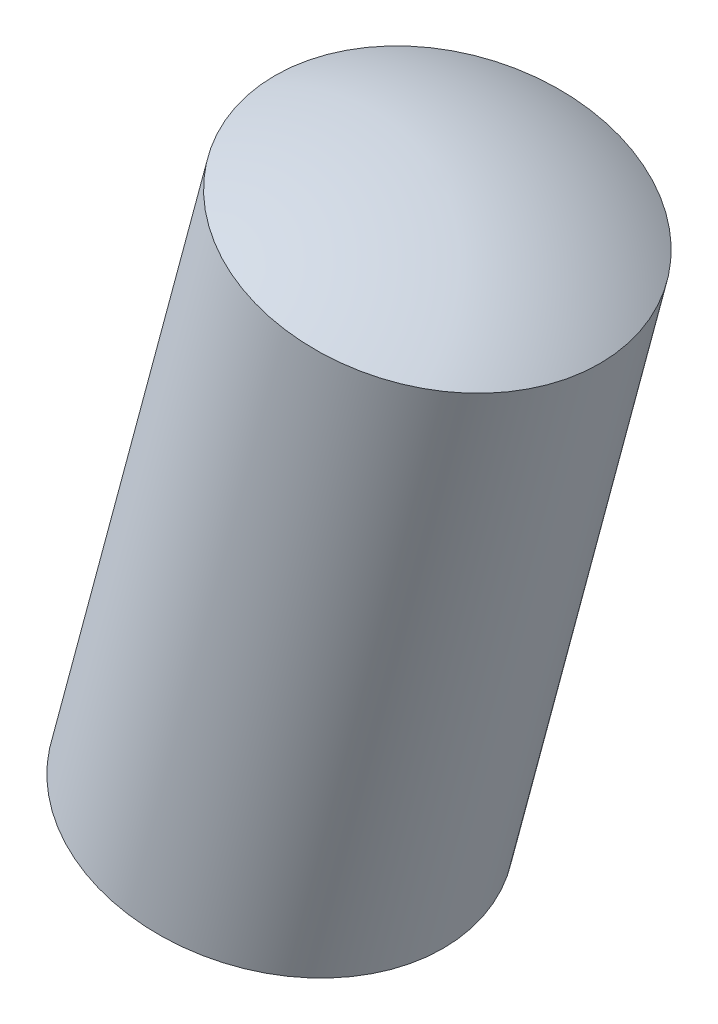
ISO-10303-21;
HEADER;
FILE_DESCRIPTION(('STEP AP214'),'2;1');
FILE_NAME('part.step','',(''),(''),'','','');
FILE_SCHEMA(('AUTOMOTIVE_DESIGN { 1 0 10303 214 1 1 1 1 }'));
ENDSEC;
DATA;
#1=APPLICATION_CONTEXT('core data for automotive mechanical design processes');
#2=APPLICATION_PROTOCOL_DEFINITION('international standard','automotive_design',2000,#1);
#3=PRODUCT_CONTEXT('',#1,'mechanical');
#4=PRODUCT('Part','Part','',(#3));
#5=PRODUCT_RELATED_PRODUCT_CATEGORY('part','',(#4));
#6=PRODUCT_DEFINITION_FORMATION('','',#4);
#7=PRODUCT_DEFINITION_CONTEXT('part definition',#1,'design');
#8=PRODUCT_DEFINITION('design','',#6,#7);
#9=PRODUCT_DEFINITION_SHAPE('','',#8);
#10=(LENGTH_UNIT() NAMED_UNIT(*) SI_UNIT(.MILLI.,.METRE.));
#11=(NAMED_UNIT(*) PLANE_ANGLE_UNIT() SI_UNIT($,.RADIAN.));
#12=(NAMED_UNIT(*) SI_UNIT($,.STERADIAN.) SOLID_ANGLE_UNIT());
#13=UNCERTAINTY_MEASURE_WITH_UNIT(LENGTH_MEASURE(1.E-05),#10,'distance_accuracy_value','');
#14=(GEOMETRIC_REPRESENTATION_CONTEXT(3) GLOBAL_UNCERTAINTY_ASSIGNED_CONTEXT((#13)) GLOBAL_UNIT_ASSIGNED_CONTEXT((#10,
#11,#12)) REPRESENTATION_CONTEXT('',''));
#15=CARTESIAN_POINT('',(0.,0.,0.));
#16=DIRECTION('',(0.,0.,1.));
#17=DIRECTION('',(1.,0.,0.));
#18=AXIS2_PLACEMENT_3D('',#15,#16,#17);
#19=CARTESIAN_POINT('',(-7.1439035579701,-26.6614110427164,0.9));
#20=DIRECTION('',(-0.965925826289068,0.258819045102522,0.));
#21=DIRECTION('',(-0.258819045102522,-0.965925826289068,0.));
#22=AXIS2_PLACEMENT_3D('',#19,#20,#21);
#23=SPHERICAL_SURFACE('',#22,3.);
#24=CARTESIAN_POINT('',(-7.1439035579701,-26.6614110427164,0.9));
#25=DIRECTION('',(0.258819045102522,0.965925826289068,0.));
#26=DIRECTION('',(0.,0.,-1.));
#27=AXIS2_PLACEMENT_3D('',#24,#25,#26);
#28=SPHERICAL_SURFACE('',#27,3.);
#29=CARTESIAN_POINT('',(-7.81633516209614,-29.17095995393,0.9));
#30=DIRECTION('',(0.258819045102522,0.965925826289068,0.));
#31=DIRECTION('',(0.,0.,-1.));
#32=AXIS2_PLACEMENT_3D('',#29,#30,#31);
#33=CIRCLE('',#32,1.5);
#34=CARTESIAN_POINT('',(-7.81633516209614,-29.17095995393,-0.6));
#35=VERTEX_POINT('',#34);
#36=EDGE_CURVE('E11',#35,#35,#33,.T.);
#37=ORIENTED_EDGE('',*,*,#36,.F.);
#38=EDGE_LOOP('',(#37));
#39=FACE_BOUND('',#38,.T.);
#40=ADVANCED_FACE('F17',(#39),#28,.T.);
#41=CARTESIAN_POINT('',(-7.09114392266856,-26.4645094031823,0.9));
#42=DIRECTION('',(-0.965925826289068,0.258819045102522,0.));
#43=DIRECTION('',(0.258819045102522,0.965925826289068,0.));
#44=AXIS2_PLACEMENT_3D('',#41,#42,#43);
#45=SPHERICAL_SURFACE('',#44,3.);
#46=CARTESIAN_POINT('',(-7.09114392266856,-26.4645094031823,0.9));
#47=DIRECTION('',(0.258819045102522,0.965925826289068,0.));
#48=DIRECTION('',(0.,0.,-1.));
#49=AXIS2_PLACEMENT_3D('',#46,#47,#48);
#50=SPHERICAL_SURFACE('',#49,3.);
#51=CARTESIAN_POINT('',(-6.41871231854252,-23.9549604919689,0.9));
#52=DIRECTION('',(0.258819045102522,0.965925826289068,0.));
#53=DIRECTION('',(0.,0.,-1.));
#54=AXIS2_PLACEMENT_3D('',#51,#52,#53);
#55=CIRCLE('',#54,1.5);
#56=CARTESIAN_POINT('',(-6.41871231854252,-23.9549604919689,-0.6));
#57=VERTEX_POINT('',#56);
#58=EDGE_CURVE('E21',#57,#57,#55,.T.);
#59=ORIENTED_EDGE('',*,*,#58,.T.);
#60=EDGE_LOOP('',(#59));
#61=FACE_BOUND('',#60,.T.);
#62=ADVANCED_FACE('F40',(#61),#50,.T.);
#63=CARTESIAN_POINT('',(-6.76811802943093,-25.2589603574591,0.9));
#64=DIRECTION('',(0.258819045102522,0.965925826289068,0.));
#65=DIRECTION('',(0.,0.,-1.));
#66=AXIS2_PLACEMENT_3D('',#63,#64,#65);
#67=CYLINDRICAL_SURFACE('',#66,1.5);
#68=ORIENTED_EDGE('',*,*,#36,.T.);
#69=EDGE_LOOP('',(#68));
#70=FACE_BOUND('',#69,.T.);
#71=ORIENTED_EDGE('',*,*,#58,.F.);
#72=EDGE_LOOP('',(#71));
#73=FACE_BOUND('',#72,.T.);
#74=ADVANCED_FACE('F19',(#70,#73),#67,.T.);
#75=CLOSED_SHELL('',(#40,#62,#74));
#76=MANIFOLD_SOLID_BREP('B1',#75);
#77=ADVANCED_BREP_SHAPE_REPRESENTATION('',(#18,#76),#14);
#78=SHAPE_DEFINITION_REPRESENTATION(#9,#77);
ENDSEC;
END-ISO-10303-21;
